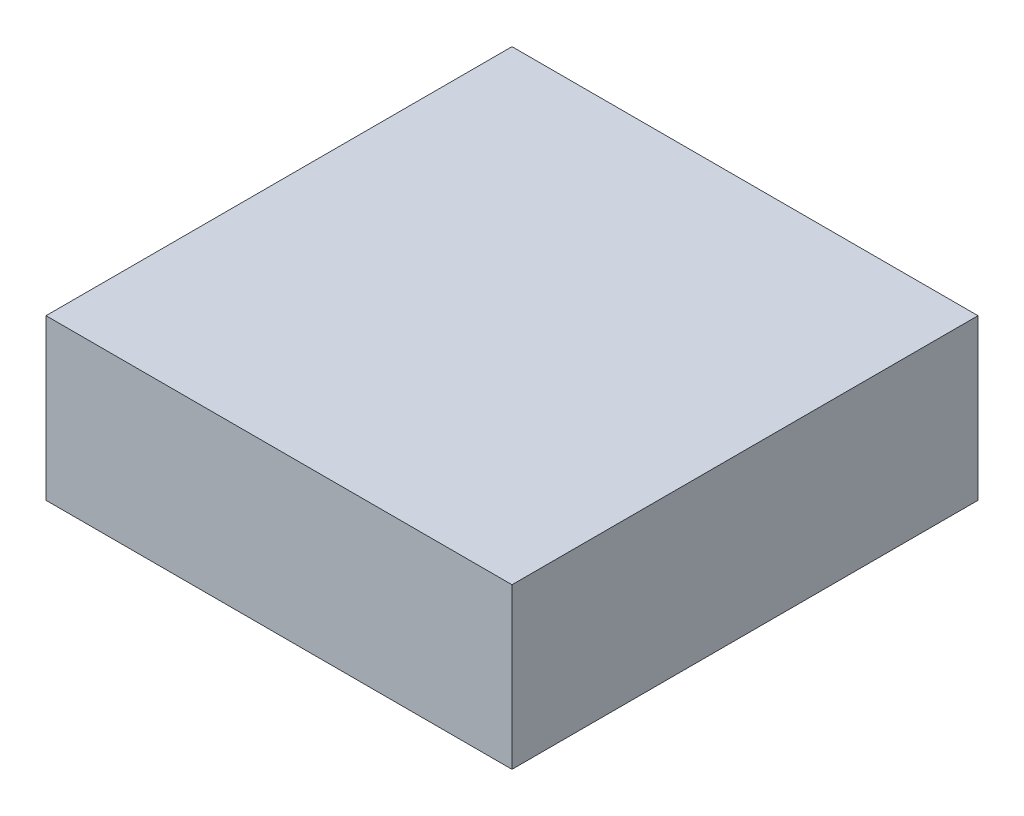
ISO-10303-21;
HEADER;
FILE_DESCRIPTION(('STEP AP214'),'2;1');
FILE_NAME('part.step','',(''),(''),'','','');
FILE_SCHEMA(('AUTOMOTIVE_DESIGN { 1 0 10303 214 1 1 1 1 }'));
ENDSEC;
DATA;
#1=APPLICATION_CONTEXT('core data for automotive mechanical design processes');
#2=APPLICATION_PROTOCOL_DEFINITION('international standard','automotive_design',2000,#1);
#3=PRODUCT_CONTEXT('',#1,'mechanical');
#4=PRODUCT('Part','Part','',(#3));
#5=PRODUCT_RELATED_PRODUCT_CATEGORY('part','',(#4));
#6=PRODUCT_DEFINITION_FORMATION('','',#4);
#7=PRODUCT_DEFINITION_CONTEXT('part definition',#1,'design');
#8=PRODUCT_DEFINITION('design','',#6,#7);
#9=PRODUCT_DEFINITION_SHAPE('','',#8);
#10=(LENGTH_UNIT() NAMED_UNIT(*) SI_UNIT(.MILLI.,.METRE.));
#11=(NAMED_UNIT(*) PLANE_ANGLE_UNIT() SI_UNIT($,.RADIAN.));
#12=(NAMED_UNIT(*) SI_UNIT($,.STERADIAN.) SOLID_ANGLE_UNIT());
#13=UNCERTAINTY_MEASURE_WITH_UNIT(LENGTH_MEASURE(1.E-05),#10,'distance_accuracy_value','');
#14=(GEOMETRIC_REPRESENTATION_CONTEXT(3) GLOBAL_UNCERTAINTY_ASSIGNED_CONTEXT((#13)) GLOBAL_UNIT_ASSIGNED_CONTEXT((#10,
#11,#12)) REPRESENTATION_CONTEXT('',''));
#15=CARTESIAN_POINT('',(0.,0.,0.));
#16=DIRECTION('',(0.,0.,1.));
#17=DIRECTION('',(1.,0.,0.));
#18=AXIS2_PLACEMENT_3D('',#15,#16,#17);
#19=CARTESIAN_POINT('',(0.,35.,0.));
#20=DIRECTION('',(1.,0.,0.));
#21=DIRECTION('',(0.,0.,-1.));
#22=AXIS2_PLACEMENT_3D('',#19,#20,#21);
#23=PLANE('',#22);
#24=DIRECTION('',(0.,0.,1.));
#25=VECTOR('',#24,1.);
#26=CARTESIAN_POINT('',(0.,0.,0.));
#27=LINE('',#26,#25);
#28=CARTESIAN_POINT('',(0.,0.,-102.));
#29=VERTEX_POINT('',#28);
#30=CARTESIAN_POINT('',(0.,0.,0.));
#31=VERTEX_POINT('',#30);
#32=EDGE_CURVE('E98',#29,#31,#27,.T.);
#33=ORIENTED_EDGE('',*,*,#32,.T.);
#34=DIRECTION('',(0.,-1.,0.));
#35=VECTOR('',#34,1.);
#36=CARTESIAN_POINT('',(0.,35.,0.));
#37=LINE('',#36,#35);
#38=CARTESIAN_POINT('',(0.,35.,0.));
#39=VERTEX_POINT('',#38);
#40=EDGE_CURVE('E11',#39,#31,#37,.T.);
#41=ORIENTED_EDGE('',*,*,#40,.F.);
#42=DIRECTION('',(0.,0.,1.));
#43=VECTOR('',#42,1.);
#44=CARTESIAN_POINT('',(0.,35.,0.));
#45=LINE('',#44,#43);
#46=CARTESIAN_POINT('',(0.,35.,-102.));
#47=VERTEX_POINT('',#46);
#48=EDGE_CURVE('E86',#47,#39,#45,.T.);
#49=ORIENTED_EDGE('',*,*,#48,.F.);
#50=DIRECTION('',(0.,-1.,0.));
#51=VECTOR('',#50,1.);
#52=CARTESIAN_POINT('',(0.,35.,-102.));
#53=LINE('',#52,#51);
#54=EDGE_CURVE('E94',#47,#29,#53,.T.);
#55=ORIENTED_EDGE('',*,*,#54,.T.);
#56=EDGE_LOOP('',(#33,#41,#49,#55));
#57=FACE_BOUND('',#56,.T.);
#58=ADVANCED_FACE('F35',(#57),#23,.F.);
#59=CARTESIAN_POINT('',(0.,35.,0.));
#60=DIRECTION('',(0.,0.,-1.));
#61=DIRECTION('',(-1.,0.,0.));
#62=AXIS2_PLACEMENT_3D('',#59,#60,#61);
#63=PLANE('',#62);
#64=DIRECTION('',(1.,0.,0.));
#65=VECTOR('',#64,1.);
#66=CARTESIAN_POINT('',(0.,0.,0.));
#67=LINE('',#66,#65);
#68=CARTESIAN_POINT('',(102.,0.,0.));
#69=VERTEX_POINT('',#68);
#70=EDGE_CURVE('E90',#31,#69,#67,.T.);
#71=ORIENTED_EDGE('',*,*,#70,.T.);
#72=DIRECTION('',(0.,-1.,0.));
#73=VECTOR('',#72,1.);
#74=CARTESIAN_POINT('',(102.,35.,0.));
#75=LINE('',#74,#73);
#76=CARTESIAN_POINT('',(102.,35.,0.));
#77=VERTEX_POINT('',#76);
#78=EDGE_CURVE('E43',#77,#69,#75,.T.);
#79=ORIENTED_EDGE('',*,*,#78,.F.);
#80=DIRECTION('',(1.,0.,0.));
#81=VECTOR('',#80,1.);
#82=CARTESIAN_POINT('',(0.,35.,0.));
#83=LINE('',#82,#81);
#84=EDGE_CURVE('E81',#39,#77,#83,.T.);
#85=ORIENTED_EDGE('',*,*,#84,.F.);
#86=ORIENTED_EDGE('',*,*,#40,.T.);
#87=EDGE_LOOP('',(#71,#79,#85,#86));
#88=FACE_BOUND('',#87,.T.);
#89=ADVANCED_FACE('F89',(#88),#63,.F.);
#90=CARTESIAN_POINT('',(102.,35.,0.));
#91=DIRECTION('',(-1.,0.,0.));
#92=DIRECTION('',(0.,0.,1.));
#93=AXIS2_PLACEMENT_3D('',#90,#91,#92);
#94=PLANE('',#93);
#95=DIRECTION('',(0.,0.,-1.));
#96=VECTOR('',#95,1.);
#97=CARTESIAN_POINT('',(102.,0.,0.));
#98=LINE('',#97,#96);
#99=CARTESIAN_POINT('',(102.,0.,-102.));
#100=VERTEX_POINT('',#99);
#101=EDGE_CURVE('E68',#69,#100,#98,.T.);
#102=ORIENTED_EDGE('',*,*,#101,.T.);
#103=DIRECTION('',(0.,-1.,0.));
#104=VECTOR('',#103,1.);
#105=CARTESIAN_POINT('',(102.,35.,-102.));
#106=LINE('',#105,#104);
#107=CARTESIAN_POINT('',(102.,35.,-102.));
#108=VERTEX_POINT('',#107);
#109=EDGE_CURVE('E91',#108,#100,#106,.T.);
#110=ORIENTED_EDGE('',*,*,#109,.F.);
#111=DIRECTION('',(0.,0.,-1.));
#112=VECTOR('',#111,1.);
#113=CARTESIAN_POINT('',(102.,35.,0.));
#114=LINE('',#113,#112);
#115=EDGE_CURVE('E84',#77,#108,#114,.T.);
#116=ORIENTED_EDGE('',*,*,#115,.F.);
#117=ORIENTED_EDGE('',*,*,#78,.T.);
#118=EDGE_LOOP('',(#102,#110,#116,#117));
#119=FACE_BOUND('',#118,.T.);
#120=ADVANCED_FACE('F92',(#119),#94,.F.);
#121=CARTESIAN_POINT('',(0.,35.,-102.));
#122=DIRECTION('',(0.,0.,1.));
#123=DIRECTION('',(1.,0.,0.));
#124=AXIS2_PLACEMENT_3D('',#121,#122,#123);
#125=PLANE('',#124);
#126=DIRECTION('',(-1.,0.,0.));
#127=VECTOR('',#126,1.);
#128=CARTESIAN_POINT('',(0.,0.,-102.));
#129=LINE('',#128,#127);
#130=EDGE_CURVE('E74',#100,#29,#129,.T.);
#131=ORIENTED_EDGE('',*,*,#130,.T.);
#132=ORIENTED_EDGE('',*,*,#54,.F.);
#133=DIRECTION('',(-1.,0.,0.));
#134=VECTOR('',#133,1.);
#135=CARTESIAN_POINT('',(0.,35.,-102.));
#136=LINE('',#135,#134);
#137=EDGE_CURVE('E51',#108,#47,#136,.T.);
#138=ORIENTED_EDGE('',*,*,#137,.F.);
#139=ORIENTED_EDGE('',*,*,#109,.T.);
#140=EDGE_LOOP('',(#131,#132,#138,#139));
#141=FACE_BOUND('',#140,.T.);
#142=ADVANCED_FACE('F105',(#141),#125,.F.);
#143=CARTESIAN_POINT('',(0.,35.,0.));
#144=DIRECTION('',(0.,-1.,0.));
#145=DIRECTION('',(0.,0.,-1.));
#146=AXIS2_PLACEMENT_3D('',#143,#144,#145);
#147=PLANE('',#146);
#148=ORIENTED_EDGE('',*,*,#48,.T.);
#149=ORIENTED_EDGE('',*,*,#84,.T.);
#150=ORIENTED_EDGE('',*,*,#115,.T.);
#151=ORIENTED_EDGE('',*,*,#137,.T.);
#152=EDGE_LOOP('',(#148,#149,#150,#151));
#153=FACE_BOUND('',#152,.T.);
#154=ADVANCED_FACE('F82',(#153),#147,.F.);
#155=CARTESIAN_POINT('',(0.,0.,0.));
#156=DIRECTION('',(0.,-1.,0.));
#157=DIRECTION('',(0.,0.,-1.));
#158=AXIS2_PLACEMENT_3D('',#155,#156,#157);
#159=PLANE('',#158);
#160=ORIENTED_EDGE('',*,*,#32,.F.);
#161=ORIENTED_EDGE('',*,*,#130,.F.);
#162=ORIENTED_EDGE('',*,*,#101,.F.);
#163=ORIENTED_EDGE('',*,*,#70,.F.);
#164=EDGE_LOOP('',(#160,#161,#162,#163));
#165=FACE_BOUND('',#164,.T.);
#166=ADVANCED_FACE('F108',(#165),#159,.T.);
#167=CLOSED_SHELL('',(#58,#89,#120,#142,#154,#166));
#168=MANIFOLD_SOLID_BREP('B2',#167);
#169=ADVANCED_BREP_SHAPE_REPRESENTATION('',(#18,#168),#14);
#170=SHAPE_DEFINITION_REPRESENTATION(#9,#169);
ENDSEC;
END-ISO-10303-21;
